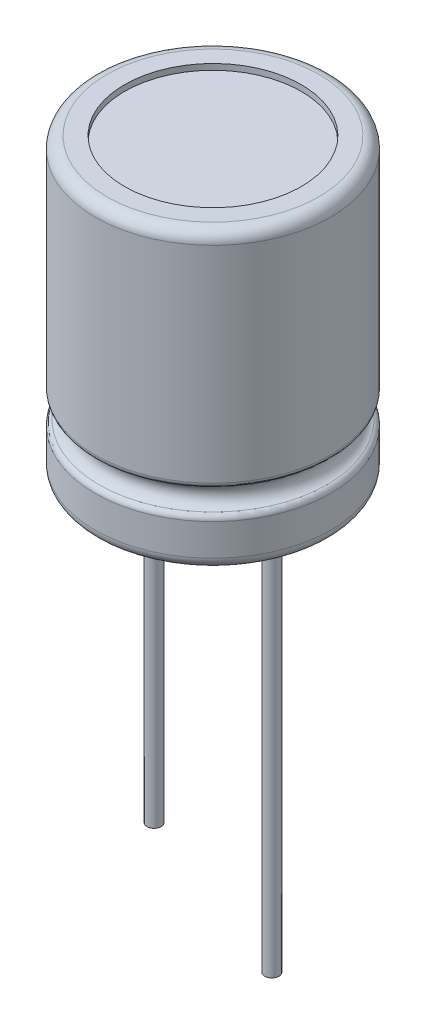
ISO-10303-21;
HEADER;
FILE_DESCRIPTION(('STEP AP214'),'2;1');
FILE_NAME('part.step','',(''),(''),'','','');
FILE_SCHEMA(('AUTOMOTIVE_DESIGN { 1 0 10303 214 1 1 1 1 }'));
ENDSEC;
DATA;
#1=APPLICATION_CONTEXT('core data for automotive mechanical design processes');
#2=APPLICATION_PROTOCOL_DEFINITION('international standard','automotive_design',2000,#1);
#3=PRODUCT_CONTEXT('',#1,'mechanical');
#4=PRODUCT('Part','Part','',(#3));
#5=PRODUCT_RELATED_PRODUCT_CATEGORY('part','',(#4));
#6=PRODUCT_DEFINITION_FORMATION('','',#4);
#7=PRODUCT_DEFINITION_CONTEXT('part definition',#1,'design');
#8=PRODUCT_DEFINITION('design','',#6,#7);
#9=PRODUCT_DEFINITION_SHAPE('','',#8);
#10=(LENGTH_UNIT() NAMED_UNIT(*) SI_UNIT(.MILLI.,.METRE.));
#11=(NAMED_UNIT(*) PLANE_ANGLE_UNIT() SI_UNIT($,.RADIAN.));
#12=(NAMED_UNIT(*) SI_UNIT($,.STERADIAN.) SOLID_ANGLE_UNIT());
#13=UNCERTAINTY_MEASURE_WITH_UNIT(LENGTH_MEASURE(1.E-05),#10,'distance_accuracy_value','');
#14=(GEOMETRIC_REPRESENTATION_CONTEXT(3) GLOBAL_UNCERTAINTY_ASSIGNED_CONTEXT((#13)) GLOBAL_UNIT_ASSIGNED_CONTEXT((#10,
#11,#12)) REPRESENTATION_CONTEXT('',''));
#15=CARTESIAN_POINT('',(0.,0.,0.));
#16=DIRECTION('',(0.,0.,1.));
#17=DIRECTION('',(1.,0.,0.));
#18=AXIS2_PLACEMENT_3D('',#15,#16,#17);
#19=CARTESIAN_POINT('',(-2.5,-17.,0.));
#20=DIRECTION('',(0.,1.,0.));
#21=DIRECTION('',(0.,0.,1.));
#22=AXIS2_PLACEMENT_3D('',#19,#20,#21);
#23=CYLINDRICAL_SURFACE('',#22,0.3);
#24=CARTESIAN_POINT('',(-2.5,0.25,0.));
#25=DIRECTION('',(0.,-1.,0.));
#26=DIRECTION('',(0.,0.,-1.));
#27=AXIS2_PLACEMENT_3D('',#24,#25,#26);
#28=CIRCLE('',#27,0.3);
#29=CARTESIAN_POINT('',(-2.5,0.25,-0.3));
#30=VERTEX_POINT('',#29);
#31=EDGE_CURVE('E65',#30,#30,#28,.T.);
#32=ORIENTED_EDGE('',*,*,#31,.T.);
#33=EDGE_LOOP('',(#32));
#34=FACE_BOUND('',#33,.T.);
#35=CARTESIAN_POINT('',(-2.5,-14.,0.));
#36=DIRECTION('',(0.,-1.,0.));
#37=DIRECTION('',(0.,0.,-1.));
#38=AXIS2_PLACEMENT_3D('',#35,#36,#37);
#39=CIRCLE('',#38,0.3);
#40=CARTESIAN_POINT('',(-2.5,-14.,-0.3));
#41=VERTEX_POINT('',#40);
#42=EDGE_CURVE('E74',#41,#41,#39,.T.);
#43=ORIENTED_EDGE('',*,*,#42,.F.);
#44=EDGE_LOOP('',(#43));
#45=FACE_BOUND('',#44,.T.);
#46=ADVANCED_FACE('F29',(#34,#45),#23,.T.);
#47=CARTESIAN_POINT('',(0.,0.25,0.));
#48=DIRECTION('',(0.,-1.,0.));
#49=DIRECTION('',(0.,0.,-1.));
#50=AXIS2_PLACEMENT_3D('',#47,#48,#49);
#51=PLANE('',#50);
#52=ORIENTED_EDGE('',*,*,#31,.F.);
#53=EDGE_LOOP('',(#52));
#54=FACE_BOUND('',#53,.T.);
#55=CARTESIAN_POINT('',(0.,0.25,0.));
#56=DIRECTION('',(0.,-1.,0.));
#57=DIRECTION('',(0.,0.,-1.));
#58=AXIS2_PLACEMENT_3D('',#55,#56,#57);
#59=CIRCLE('',#58,3.75);
#60=CARTESIAN_POINT('',(0.,0.25,-3.75));
#61=VERTEX_POINT('',#60);
#62=EDGE_CURVE('E61',#61,#61,#59,.T.);
#63=ORIENTED_EDGE('',*,*,#62,.T.);
#64=EDGE_LOOP('',(#63));
#65=FACE_BOUND('',#64,.T.);
#66=CARTESIAN_POINT('',(2.5,0.25,0.));
#67=DIRECTION('',(0.,-1.,0.));
#68=DIRECTION('',(0.,0.,-1.));
#69=AXIS2_PLACEMENT_3D('',#66,#67,#68);
#70=CIRCLE('',#69,0.3);
#71=CARTESIAN_POINT('',(2.5,0.25,-0.3));
#72=VERTEX_POINT('',#71);
#73=EDGE_CURVE('E71',#72,#72,#70,.T.);
#74=ORIENTED_EDGE('',*,*,#73,.F.);
#75=EDGE_LOOP('',(#74));
#76=FACE_BOUND('',#75,.T.);
#77=ADVANCED_FACE('F118',(#54,#65,#76),#51,.T.);
#78=CARTESIAN_POINT('',(0.,12.5,0.));
#79=DIRECTION('',(0.,-1.,0.));
#80=DIRECTION('',(0.,0.,-1.));
#81=AXIS2_PLACEMENT_3D('',#78,#79,#80);
#82=CYLINDRICAL_SURFACE('',#81,5.);
#83=CARTESIAN_POINT('',(0.,1.84607916782785,0.));
#84=DIRECTION('',(0.,1.,0.));
#85=DIRECTION('',(0.,0.,1.));
#86=AXIS2_PLACEMENT_3D('',#83,#84,#85);
#87=CIRCLE('',#86,5.);
#88=CARTESIAN_POINT('',(0.,1.84607916782785,5.));
#89=VERTEX_POINT('',#88);
#90=EDGE_CURVE('E44',#89,#89,#87,.F.);
#91=ORIENTED_EDGE('',*,*,#90,.T.);
#92=EDGE_LOOP('',(#91));
#93=FACE_BOUND('',#92,.T.);
#94=CARTESIAN_POINT('',(0.,0.5,0.));
#95=DIRECTION('',(0.,1.,0.));
#96=DIRECTION('',(0.,0.,1.));
#97=AXIS2_PLACEMENT_3D('',#94,#95,#96);
#98=CIRCLE('',#97,5.);
#99=CARTESIAN_POINT('',(0.,0.5,5.));
#100=VERTEX_POINT('',#99);
#101=EDGE_CURVE('E58',#100,#100,#98,.T.);
#102=ORIENTED_EDGE('',*,*,#101,.T.);
#103=EDGE_LOOP('',(#102));
#104=FACE_BOUND('',#103,.T.);
#105=ADVANCED_FACE('F124',(#93,#104),#82,.T.);
#106=CARTESIAN_POINT('',(0.,0.,0.));
#107=DIRECTION('',(0.,1.,0.));
#108=DIRECTION('',(0.,0.,1.));
#109=AXIS2_PLACEMENT_3D('',#106,#107,#108);
#110=PLANE('',#109);
#111=CARTESIAN_POINT('',(0.,0.,0.));
#112=DIRECTION('',(0.,-1.,0.));
#113=DIRECTION('',(0.,0.,-1.));
#114=AXIS2_PLACEMENT_3D('',#111,#112,#113);
#115=CIRCLE('',#114,3.75);
#116=CARTESIAN_POINT('',(0.,0.,-3.75));
#117=VERTEX_POINT('',#116);
#118=EDGE_CURVE('E62',#117,#117,#115,.T.);
#119=ORIENTED_EDGE('',*,*,#118,.F.);
#120=EDGE_LOOP('',(#119));
#121=FACE_BOUND('',#120,.T.);
#122=CARTESIAN_POINT('',(0.,0.,0.));
#123=DIRECTION('',(0.,1.,0.));
#124=DIRECTION('',(0.,0.,1.));
#125=AXIS2_PLACEMENT_3D('',#122,#123,#124);
#126=CIRCLE('',#125,4.5);
#127=CARTESIAN_POINT('',(0.,0.,4.5));
#128=VERTEX_POINT('',#127);
#129=EDGE_CURVE('E55',#128,#128,#126,.F.);
#130=ORIENTED_EDGE('',*,*,#129,.T.);
#131=EDGE_LOOP('',(#130));
#132=FACE_BOUND('',#131,.T.);
#133=ADVANCED_FACE('F137',(#121,#132),#110,.F.);
#134=CARTESIAN_POINT('',(0.,2.5531859490144,0.));
#135=DIRECTION('',(0.,-1.,0.));
#136=DIRECTION('',(0.,0.,-1.));
#137=AXIS2_PLACEMENT_3D('',#134,#135,#136);
#138=TOROIDAL_SURFACE('',#137,5.,0.5);
#139=CARTESIAN_POINT('',(0.,2.08178142822344,0.));
#140=DIRECTION('',(0.,1.,0.));
#141=DIRECTION('',(0.,0.,1.));
#142=AXIS2_PLACEMENT_3D('',#139,#140,#141);
#143=CIRCLE('',#142,4.83333333333336);
#144=CARTESIAN_POINT('',(0.,2.08178142822344,4.83333333333336));
#145=VERTEX_POINT('',#144);
#146=EDGE_CURVE('E36',#145,#145,#143,.T.);
#147=ORIENTED_EDGE('',*,*,#146,.T.);
#148=EDGE_LOOP('',(#147));
#149=FACE_BOUND('',#148,.T.);
#150=CARTESIAN_POINT('',(0.,3.02459046980536,0.));
#151=DIRECTION('',(0.,-1.,0.));
#152=DIRECTION('',(0.,0.,-1.));
#153=AXIS2_PLACEMENT_3D('',#150,#151,#152);
#154=CIRCLE('',#153,4.83333333333336);
#155=CARTESIAN_POINT('',(0.,3.02459046980536,-4.83333333333336));
#156=VERTEX_POINT('',#155);
#157=EDGE_CURVE('E40',#156,#156,#154,.T.);
#158=ORIENTED_EDGE('',*,*,#157,.T.);
#159=EDGE_LOOP('',(#158));
#160=FACE_BOUND('',#159,.T.);
#161=ADVANCED_FACE('F99',(#149,#160),#138,.F.);
#162=CARTESIAN_POINT('',(0.,12.5,0.));
#163=DIRECTION('',(0.,1.,0.));
#164=DIRECTION('',(0.,0.,1.));
#165=AXIS2_PLACEMENT_3D('',#162,#163,#164);
#166=PLANE('',#165);
#167=CARTESIAN_POINT('',(0.,12.5,0.));
#168=DIRECTION('',(0.,1.,0.));
#169=DIRECTION('',(0.,0.,1.));
#170=AXIS2_PLACEMENT_3D('',#167,#168,#169);
#171=CIRCLE('',#170,3.75);
#172=CARTESIAN_POINT('',(0.,12.5,3.75));
#173=VERTEX_POINT('',#172);
#174=EDGE_CURVE('E80',#173,#173,#171,.T.);
#175=ORIENTED_EDGE('',*,*,#174,.F.);
#176=EDGE_LOOP('',(#175));
#177=FACE_BOUND('',#176,.T.);
#178=CARTESIAN_POINT('',(0.,12.5,0.));
#179=DIRECTION('',(0.,1.,0.));
#180=DIRECTION('',(0.,0.,1.));
#181=AXIS2_PLACEMENT_3D('',#178,#179,#180);
#182=CIRCLE('',#181,4.5);
#183=CARTESIAN_POINT('',(0.,12.5,4.5));
#184=VERTEX_POINT('',#183);
#185=EDGE_CURVE('E52',#184,#184,#182,.T.);
#186=ORIENTED_EDGE('',*,*,#185,.T.);
#187=EDGE_LOOP('',(#186));
#188=FACE_BOUND('',#187,.T.);
#189=ADVANCED_FACE('F95',(#177,#188),#166,.T.);
#190=CARTESIAN_POINT('',(0.,3.26029273020095,0.));
#191=DIRECTION('',(0.,1.,0.));
#192=DIRECTION('',(0.,0.,1.));
#193=AXIS2_PLACEMENT_3D('',#190,#191,#192);
#194=CIRCLE('',#193,5.);
#195=CARTESIAN_POINT('',(0.,3.26029273020095,5.));
#196=VERTEX_POINT('',#195);
#197=EDGE_CURVE('E10',#196,#196,#194,.T.);
#198=ORIENTED_EDGE('',*,*,#197,.T.);
#199=EDGE_LOOP('',(#198));
#200=FACE_BOUND('',#199,.T.);
#201=CARTESIAN_POINT('',(0.,12.,0.));
#202=DIRECTION('',(0.,1.,0.));
#203=DIRECTION('',(0.,0.,1.));
#204=AXIS2_PLACEMENT_3D('',#201,#202,#203);
#205=CIRCLE('',#204,5.);
#206=CARTESIAN_POINT('',(0.,12.,5.));
#207=VERTEX_POINT('',#206);
#208=EDGE_CURVE('E49',#207,#207,#205,.F.);
#209=ORIENTED_EDGE('',*,*,#208,.T.);
#210=EDGE_LOOP('',(#209));
#211=FACE_BOUND('',#210,.T.);
#212=ADVANCED_FACE('F98',(#200,#211),#82,.T.);
#213=CARTESIAN_POINT('',(0.,0.5,0.));
#214=DIRECTION('',(0.,1.,0.));
#215=DIRECTION('',(0.,0.,1.));
#216=AXIS2_PLACEMENT_3D('',#213,#214,#215);
#217=TOROIDAL_SURFACE('',#216,4.5,0.5);
#218=ORIENTED_EDGE('',*,*,#129,.F.);
#219=EDGE_LOOP('',(#218));
#220=FACE_BOUND('',#219,.T.);
#221=ORIENTED_EDGE('',*,*,#101,.F.);
#222=EDGE_LOOP('',(#221));
#223=FACE_BOUND('',#222,.T.);
#224=ADVANCED_FACE('F106',(#220,#223),#217,.T.);
#225=CARTESIAN_POINT('',(0.,12.,0.));
#226=DIRECTION('',(0.,1.,0.));
#227=DIRECTION('',(0.,0.,1.));
#228=AXIS2_PLACEMENT_3D('',#225,#226,#227);
#229=TOROIDAL_SURFACE('',#228,4.5,0.5);
#230=ORIENTED_EDGE('',*,*,#208,.F.);
#231=EDGE_LOOP('',(#230));
#232=FACE_BOUND('',#231,.T.);
#233=ORIENTED_EDGE('',*,*,#185,.F.);
#234=EDGE_LOOP('',(#233));
#235=FACE_BOUND('',#234,.T.);
#236=ADVANCED_FACE('F103',(#232,#235),#229,.T.);
#237=CARTESIAN_POINT('',(0.,1.84607916782785,0.));
#238=DIRECTION('',(0.,1.,0.));
#239=DIRECTION('',(0.,0.,1.));
#240=AXIS2_PLACEMENT_3D('',#237,#238,#239);
#241=TOROIDAL_SURFACE('',#240,4.75,0.25);
#242=ORIENTED_EDGE('',*,*,#146,.F.);
#243=EDGE_LOOP('',(#242));
#244=FACE_BOUND('',#243,.T.);
#245=ORIENTED_EDGE('',*,*,#90,.F.);
#246=EDGE_LOOP('',(#245));
#247=FACE_BOUND('',#246,.T.);
#248=ADVANCED_FACE('F105',(#244,#247),#241,.T.);
#249=CARTESIAN_POINT('',(0.,3.26029273020095,0.));
#250=DIRECTION('',(0.,1.,0.));
#251=DIRECTION('',(0.,0.,1.));
#252=AXIS2_PLACEMENT_3D('',#249,#250,#251);
#253=TOROIDAL_SURFACE('',#252,4.75,0.25);
#254=ORIENTED_EDGE('',*,*,#197,.F.);
#255=EDGE_LOOP('',(#254));
#256=FACE_BOUND('',#255,.T.);
#257=ORIENTED_EDGE('',*,*,#157,.F.);
#258=EDGE_LOOP('',(#257));
#259=FACE_BOUND('',#258,.T.);
#260=ADVANCED_FACE('F31',(#256,#259),#253,.T.);
#261=CARTESIAN_POINT('',(0.,0.25,0.));
#262=DIRECTION('',(0.,-1.,0.));
#263=DIRECTION('',(0.,0.,-1.));
#264=AXIS2_PLACEMENT_3D('',#261,#262,#263);
#265=CYLINDRICAL_SURFACE('',#264,3.75);
#266=ORIENTED_EDGE('',*,*,#62,.F.);
#267=EDGE_LOOP('',(#266));
#268=FACE_BOUND('',#267,.T.);
#269=ORIENTED_EDGE('',*,*,#118,.T.);
#270=EDGE_LOOP('',(#269));
#271=FACE_BOUND('',#270,.T.);
#272=ADVANCED_FACE('F132',(#268,#271),#265,.F.);
#273=CARTESIAN_POINT('',(2.5,-17.,0.));
#274=DIRECTION('',(0.,1.,0.));
#275=DIRECTION('',(0.,0.,1.));
#276=AXIS2_PLACEMENT_3D('',#273,#274,#275);
#277=CYLINDRICAL_SURFACE('',#276,0.3);
#278=CARTESIAN_POINT('',(2.5,-17.,0.));
#279=DIRECTION('',(0.,-1.,0.));
#280=DIRECTION('',(0.,0.,-1.));
#281=AXIS2_PLACEMENT_3D('',#278,#279,#280);
#282=CIRCLE('',#281,0.3);
#283=CARTESIAN_POINT('',(2.5,-17.,-0.3));
#284=VERTEX_POINT('',#283);
#285=EDGE_CURVE('E70',#284,#284,#282,.T.);
#286=ORIENTED_EDGE('',*,*,#285,.F.);
#287=EDGE_LOOP('',(#286));
#288=FACE_BOUND('',#287,.T.);
#289=ORIENTED_EDGE('',*,*,#73,.T.);
#290=EDGE_LOOP('',(#289));
#291=FACE_BOUND('',#290,.T.);
#292=ADVANCED_FACE('F129',(#288,#291),#277,.T.);
#293=CARTESIAN_POINT('',(2.5,-17.,0.));
#294=DIRECTION('',(0.,-1.,0.));
#295=DIRECTION('',(0.,0.,-1.));
#296=AXIS2_PLACEMENT_3D('',#293,#294,#295);
#297=PLANE('',#296);
#298=ORIENTED_EDGE('',*,*,#285,.T.);
#299=EDGE_LOOP('',(#298));
#300=FACE_BOUND('',#299,.T.);
#301=ADVANCED_FACE('F205',(#300),#297,.T.);
#302=CARTESIAN_POINT('',(-2.5,-14.,0.));
#303=DIRECTION('',(0.,-1.,0.));
#304=DIRECTION('',(0.,0.,-1.));
#305=AXIS2_PLACEMENT_3D('',#302,#303,#304);
#306=PLANE('',#305);
#307=ORIENTED_EDGE('',*,*,#42,.T.);
#308=EDGE_LOOP('',(#307));
#309=FACE_BOUND('',#308,.T.);
#310=ADVANCED_FACE('F91',(#309),#306,.T.);
#311=CARTESIAN_POINT('',(0.,12.25,0.));
#312=DIRECTION('',(0.,1.,0.));
#313=DIRECTION('',(0.,0.,1.));
#314=AXIS2_PLACEMENT_3D('',#311,#312,#313);
#315=CYLINDRICAL_SURFACE('',#314,3.75);
#316=CARTESIAN_POINT('',(0.,12.25,0.));
#317=DIRECTION('',(0.,1.,0.));
#318=DIRECTION('',(0.,0.,1.));
#319=AXIS2_PLACEMENT_3D('',#316,#317,#318);
#320=CIRCLE('',#319,3.75);
#321=CARTESIAN_POINT('',(0.,12.25,3.75));
#322=VERTEX_POINT('',#321);
#323=EDGE_CURVE('E79',#322,#322,#320,.T.);
#324=ORIENTED_EDGE('',*,*,#323,.F.);
#325=EDGE_LOOP('',(#324));
#326=FACE_BOUND('',#325,.T.);
#327=ORIENTED_EDGE('',*,*,#174,.T.);
#328=EDGE_LOOP('',(#327));
#329=FACE_BOUND('',#328,.T.);
#330=ADVANCED_FACE('F88',(#326,#329),#315,.F.);
#331=CARTESIAN_POINT('',(0.,12.25,0.));
#332=DIRECTION('',(0.,1.,0.));
#333=DIRECTION('',(0.,0.,1.));
#334=AXIS2_PLACEMENT_3D('',#331,#332,#333);
#335=PLANE('',#334);
#336=ORIENTED_EDGE('',*,*,#323,.T.);
#337=EDGE_LOOP('',(#336));
#338=FACE_BOUND('',#337,.T.);
#339=ADVANCED_FACE('F86',(#338),#335,.T.);
#340=CLOSED_SHELL('',(#46,#77,#105,#133,#161,#189,#212,#224,#236,#248,#260,#272,#292,#301,#310,
#330,#339));
#341=MANIFOLD_SOLID_BREP('B2',#340);
#342=ADVANCED_BREP_SHAPE_REPRESENTATION('',(#18,#341),#14);
#343=SHAPE_DEFINITION_REPRESENTATION(#9,#342);
ENDSEC;
END-ISO-10303-21;
